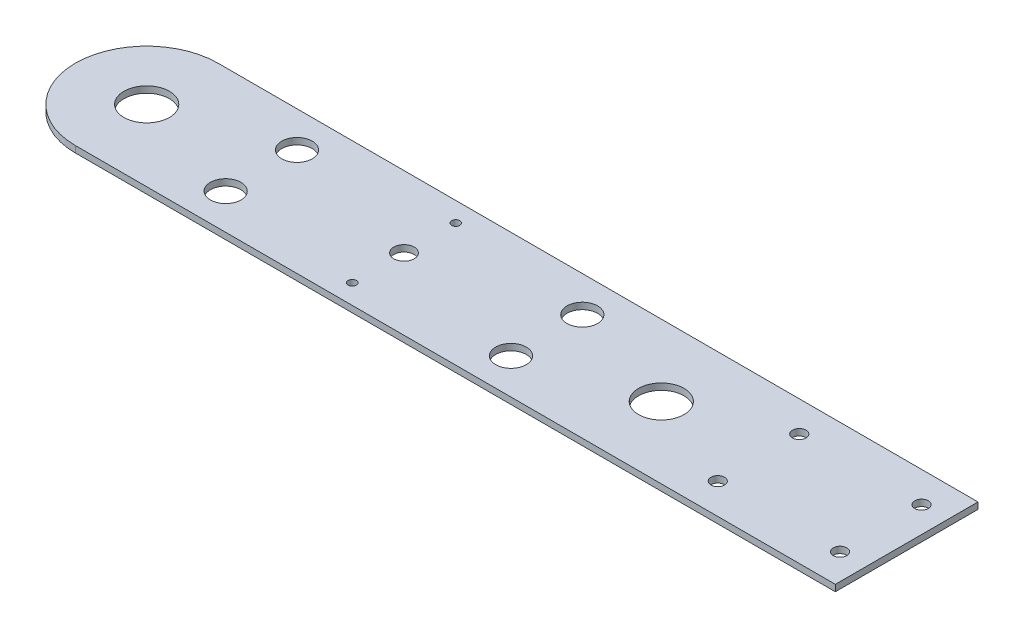
ISO-10303-21;
HEADER;
FILE_DESCRIPTION(('STEP AP214'),'2;1');
FILE_NAME('part.step','',(''),(''),'','','');
FILE_SCHEMA(('AUTOMOTIVE_DESIGN { 1 0 10303 214 1 1 1 1 }'));
ENDSEC;
DATA;
#1=APPLICATION_CONTEXT('core data for automotive mechanical design processes');
#2=APPLICATION_PROTOCOL_DEFINITION('international standard','automotive_design',2000,#1);
#3=PRODUCT_CONTEXT('',#1,'mechanical');
#4=PRODUCT('Part','Part','',(#3));
#5=PRODUCT_RELATED_PRODUCT_CATEGORY('part','',(#4));
#6=PRODUCT_DEFINITION_FORMATION('','',#4);
#7=PRODUCT_DEFINITION_CONTEXT('part definition',#1,'design');
#8=PRODUCT_DEFINITION('design','',#6,#7);
#9=PRODUCT_DEFINITION_SHAPE('','',#8);
#10=(LENGTH_UNIT() NAMED_UNIT(*) SI_UNIT(.MILLI.,.METRE.));
#11=(NAMED_UNIT(*) PLANE_ANGLE_UNIT() SI_UNIT($,.RADIAN.));
#12=(NAMED_UNIT(*) SI_UNIT($,.STERADIAN.) SOLID_ANGLE_UNIT());
#13=UNCERTAINTY_MEASURE_WITH_UNIT(LENGTH_MEASURE(1.E-05),#10,'distance_accuracy_value','');
#14=(GEOMETRIC_REPRESENTATION_CONTEXT(3) GLOBAL_UNCERTAINTY_ASSIGNED_CONTEXT((#13)) GLOBAL_UNIT_ASSIGNED_CONTEXT((#10,
#11,#12)) REPRESENTATION_CONTEXT('',''));
#15=CARTESIAN_POINT('',(0.,0.,0.));
#16=DIRECTION('',(0.,0.,1.));
#17=DIRECTION('',(1.,0.,0.));
#18=AXIS2_PLACEMENT_3D('',#15,#16,#17);
#19=CARTESIAN_POINT('',(-1.02661504070082E-12,3.175,-34.9999999999929));
#20=DIRECTION('',(0.,0.,-1.));
#21=DIRECTION('',(-1.,0.,0.));
#22=AXIS2_PLACEMENT_3D('',#19,#20,#21);
#23=PLANE('',#22);
#24=DIRECTION('',(1.,0.,0.));
#25=VECTOR('',#24,1.);
#26=CARTESIAN_POINT('',(-1.02661504070082E-12,0.,-34.9999999999929));
#27=LINE('',#26,#25);
#28=CARTESIAN_POINT('',(-126.258214395413,0.,-35.0000000000012));
#29=VERTEX_POINT('',#28);
#30=CARTESIAN_POINT('',(246.658214395413,0.,-35.0000000000001));
#31=VERTEX_POINT('',#30);
#32=EDGE_CURVE('E144',#29,#31,#27,.T.);
#33=ORIENTED_EDGE('',*,*,#32,.F.);
#34=DIRECTION('',(0.,-1.,0.));
#35=VECTOR('',#34,1.);
#36=CARTESIAN_POINT('',(-126.258214395413,3.175,-35.0000000000012));
#37=LINE('',#36,#35);
#38=CARTESIAN_POINT('',(-126.258214395413,3.175,-35.0000000000012));
#39=VERTEX_POINT('',#38);
#40=EDGE_CURVE('E11',#39,#29,#37,.T.);
#41=ORIENTED_EDGE('',*,*,#40,.F.);
#42=DIRECTION('',(1.,0.,0.));
#43=VECTOR('',#42,1.);
#44=CARTESIAN_POINT('',(-1.02661504070082E-12,3.175,-34.9999999999929));
#45=LINE('',#44,#43);
#46=CARTESIAN_POINT('',(246.658214395413,3.175,-35.0000000000001));
#47=VERTEX_POINT('',#46);
#48=EDGE_CURVE('E93',#39,#47,#45,.T.);
#49=ORIENTED_EDGE('',*,*,#48,.T.);
#50=DIRECTION('',(0.,-1.,0.));
#51=VECTOR('',#50,1.);
#52=CARTESIAN_POINT('',(246.658214395413,3.175,-35.0000000000001));
#53=LINE('',#52,#51);
#54=EDGE_CURVE('E74',#47,#31,#53,.T.);
#55=ORIENTED_EDGE('',*,*,#54,.T.);
#56=EDGE_LOOP('',(#33,#41,#49,#55));
#57=FACE_BOUND('',#56,.T.);
#58=ADVANCED_FACE('F35',(#57),#23,.T.);
#59=CARTESIAN_POINT('',(-126.258214395413,3.175,-2.40182936781888E-12));
#60=DIRECTION('',(0.,-1.,0.));
#61=DIRECTION('',(0.,0.,-1.));
#62=AXIS2_PLACEMENT_3D('',#59,#60,#61);
#63=CYLINDRICAL_SURFACE('',#62,35.);
#64=CARTESIAN_POINT('',(-126.258214395413,0.,-2.40182936781888E-12));
#65=DIRECTION('',(0.,1.,0.));
#66=DIRECTION('',(0.,0.,1.));
#67=AXIS2_PLACEMENT_3D('',#64,#65,#66);
#68=CIRCLE('',#67,35.);
#69=CARTESIAN_POINT('',(-126.258214395413,0.,34.9999999999988));
#70=VERTEX_POINT('',#69);
#71=EDGE_CURVE('E98',#29,#70,#68,.T.);
#72=ORIENTED_EDGE('',*,*,#71,.T.);
#73=DIRECTION('',(0.,-1.,0.));
#74=VECTOR('',#73,1.);
#75=CARTESIAN_POINT('',(-126.258214395413,3.175,34.9999999999988));
#76=LINE('',#75,#74);
#77=CARTESIAN_POINT('',(-126.258214395413,3.175,34.9999999999988));
#78=VERTEX_POINT('',#77);
#79=EDGE_CURVE('E44',#78,#70,#76,.T.);
#80=ORIENTED_EDGE('',*,*,#79,.F.);
#81=CARTESIAN_POINT('',(-126.258214395413,3.175,-2.40182936781888E-12));
#82=DIRECTION('',(0.,1.,0.));
#83=DIRECTION('',(0.,0.,1.));
#84=AXIS2_PLACEMENT_3D('',#81,#82,#83);
#85=CIRCLE('',#84,35.);
#86=EDGE_CURVE('E89',#39,#78,#85,.T.);
#87=ORIENTED_EDGE('',*,*,#86,.F.);
#88=ORIENTED_EDGE('',*,*,#40,.T.);
#89=EDGE_LOOP('',(#72,#80,#87,#88));
#90=FACE_BOUND('',#89,.T.);
#91=ADVANCED_FACE('F96',(#90),#63,.T.);
#92=CARTESIAN_POINT('',(0.,3.175,35.));
#93=DIRECTION('',(0.,0.,-1.));
#94=DIRECTION('',(-1.,0.,0.));
#95=AXIS2_PLACEMENT_3D('',#92,#93,#94);
#96=PLANE('',#95);
#97=DIRECTION('',(1.,0.,0.));
#98=VECTOR('',#97,1.);
#99=CARTESIAN_POINT('',(0.,0.,35.));
#100=LINE('',#99,#98);
#101=CARTESIAN_POINT('',(246.658214395413,0.,34.9999999999999));
#102=VERTEX_POINT('',#101);
#103=EDGE_CURVE('E141',#70,#102,#100,.T.);
#104=ORIENTED_EDGE('',*,*,#103,.T.);
#105=DIRECTION('',(0.,-1.,0.));
#106=VECTOR('',#105,1.);
#107=CARTESIAN_POINT('',(246.658214395413,3.175,34.9999999999999));
#108=LINE('',#107,#106);
#109=CARTESIAN_POINT('',(246.658214395413,3.175,34.9999999999999));
#110=VERTEX_POINT('',#109);
#111=EDGE_CURVE('E88',#110,#102,#108,.T.);
#112=ORIENTED_EDGE('',*,*,#111,.F.);
#113=DIRECTION('',(1.,0.,0.));
#114=VECTOR('',#113,1.);
#115=CARTESIAN_POINT('',(0.,3.175,35.));
#116=LINE('',#115,#114);
#117=EDGE_CURVE('E82',#78,#110,#116,.T.);
#118=ORIENTED_EDGE('',*,*,#117,.F.);
#119=ORIENTED_EDGE('',*,*,#79,.T.);
#120=EDGE_LOOP('',(#104,#112,#118,#119));
#121=FACE_BOUND('',#120,.T.);
#122=ADVANCED_FACE('F85',(#121),#96,.F.);
#123=CARTESIAN_POINT('',(-70.,3.175,17.5));
#124=DIRECTION('',(0.,-1.,0.));
#125=DIRECTION('',(0.,0.,-1.));
#126=AXIS2_PLACEMENT_3D('',#123,#124,#125);
#127=CYLINDRICAL_SURFACE('',#126,7.50000000000001);
#128=CARTESIAN_POINT('',(-70.,3.175,17.5));
#129=DIRECTION('',(0.,1.,0.));
#130=DIRECTION('',(0.,0.,1.));
#131=AXIS2_PLACEMENT_3D('',#128,#129,#130);
#132=CIRCLE('',#131,7.50000000000001);
#133=CARTESIAN_POINT('',(-70.,3.175,25.));
#134=VERTEX_POINT('',#133);
#135=EDGE_CURVE('E151',#134,#134,#132,.T.);
#136=ORIENTED_EDGE('',*,*,#135,.T.);
#137=EDGE_LOOP('',(#136));
#138=FACE_BOUND('',#137,.T.);
#139=CARTESIAN_POINT('',(-70.,0.,17.5));
#140=DIRECTION('',(0.,1.,0.));
#141=DIRECTION('',(0.,0.,1.));
#142=AXIS2_PLACEMENT_3D('',#139,#140,#141);
#143=CIRCLE('',#142,7.50000000000001);
#144=CARTESIAN_POINT('',(-70.,0.,25.));
#145=VERTEX_POINT('',#144);
#146=EDGE_CURVE('E107',#145,#145,#143,.T.);
#147=ORIENTED_EDGE('',*,*,#146,.F.);
#148=EDGE_LOOP('',(#147));
#149=FACE_BOUND('',#148,.T.);
#150=ADVANCED_FACE('F211',(#138,#149),#127,.F.);
#151=CARTESIAN_POINT('',(-70.,3.175,-17.5));
#152=DIRECTION('',(0.,-1.,0.));
#153=DIRECTION('',(0.,0.,-1.));
#154=AXIS2_PLACEMENT_3D('',#151,#152,#153);
#155=CYLINDRICAL_SURFACE('',#154,7.50000000000001);
#156=CARTESIAN_POINT('',(-70.,3.175,-17.5));
#157=DIRECTION('',(0.,1.,0.));
#158=DIRECTION('',(0.,0.,1.));
#159=AXIS2_PLACEMENT_3D('',#156,#157,#158);
#160=CIRCLE('',#159,7.50000000000001);
#161=CARTESIAN_POINT('',(-70.,3.175,-9.99999999999999));
#162=VERTEX_POINT('',#161);
#163=EDGE_CURVE('E154',#162,#162,#160,.T.);
#164=ORIENTED_EDGE('',*,*,#163,.T.);
#165=EDGE_LOOP('',(#164));
#166=FACE_BOUND('',#165,.T.);
#167=CARTESIAN_POINT('',(-70.,0.,-17.5));
#168=DIRECTION('',(0.,1.,0.));
#169=DIRECTION('',(0.,0.,1.));
#170=AXIS2_PLACEMENT_3D('',#167,#168,#169);
#171=CIRCLE('',#170,7.50000000000001);
#172=CARTESIAN_POINT('',(-70.,0.,-9.99999999999999));
#173=VERTEX_POINT('',#172);
#174=EDGE_CURVE('E110',#173,#173,#171,.T.);
#175=ORIENTED_EDGE('',*,*,#174,.F.);
#176=EDGE_LOOP('',(#175));
#177=FACE_BOUND('',#176,.T.);
#178=ADVANCED_FACE('F251',(#166,#177),#155,.F.);
#179=CARTESIAN_POINT('',(70.,3.175,-17.5));
#180=DIRECTION('',(0.,-1.,0.));
#181=DIRECTION('',(0.,0.,-1.));
#182=AXIS2_PLACEMENT_3D('',#179,#180,#181);
#183=CYLINDRICAL_SURFACE('',#182,7.50000000000001);
#184=CARTESIAN_POINT('',(70.,3.175,-17.5));
#185=DIRECTION('',(0.,1.,0.));
#186=DIRECTION('',(0.,0.,1.));
#187=AXIS2_PLACEMENT_3D('',#184,#185,#186);
#188=CIRCLE('',#187,7.50000000000001);
#189=CARTESIAN_POINT('',(70.,3.175,-10.));
#190=VERTEX_POINT('',#189);
#191=EDGE_CURVE('E157',#190,#190,#188,.T.);
#192=ORIENTED_EDGE('',*,*,#191,.T.);
#193=EDGE_LOOP('',(#192));
#194=FACE_BOUND('',#193,.T.);
#195=CARTESIAN_POINT('',(70.,0.,-17.5));
#196=DIRECTION('',(0.,1.,0.));
#197=DIRECTION('',(0.,0.,1.));
#198=AXIS2_PLACEMENT_3D('',#195,#196,#197);
#199=CIRCLE('',#198,7.50000000000001);
#200=CARTESIAN_POINT('',(70.,0.,-10.));
#201=VERTEX_POINT('',#200);
#202=EDGE_CURVE('E113',#201,#201,#199,.T.);
#203=ORIENTED_EDGE('',*,*,#202,.F.);
#204=EDGE_LOOP('',(#203));
#205=FACE_BOUND('',#204,.T.);
#206=ADVANCED_FACE('F247',(#194,#205),#183,.F.);
#207=CARTESIAN_POINT('',(70.,3.175,17.5));
#208=DIRECTION('',(0.,-1.,0.));
#209=DIRECTION('',(0.,0.,-1.));
#210=AXIS2_PLACEMENT_3D('',#207,#208,#209);
#211=CYLINDRICAL_SURFACE('',#210,7.50000000000001);
#212=CARTESIAN_POINT('',(70.,3.175,17.5));
#213=DIRECTION('',(0.,1.,0.));
#214=DIRECTION('',(0.,0.,1.));
#215=AXIS2_PLACEMENT_3D('',#212,#213,#214);
#216=CIRCLE('',#215,7.50000000000001);
#217=CARTESIAN_POINT('',(70.,3.175,25.));
#218=VERTEX_POINT('',#217);
#219=EDGE_CURVE('E160',#218,#218,#216,.T.);
#220=ORIENTED_EDGE('',*,*,#219,.T.);
#221=EDGE_LOOP('',(#220));
#222=FACE_BOUND('',#221,.T.);
#223=CARTESIAN_POINT('',(70.,0.,17.5));
#224=DIRECTION('',(0.,1.,0.));
#225=DIRECTION('',(0.,0.,1.));
#226=AXIS2_PLACEMENT_3D('',#223,#224,#225);
#227=CIRCLE('',#226,7.50000000000001);
#228=CARTESIAN_POINT('',(70.,0.,25.));
#229=VERTEX_POINT('',#228);
#230=EDGE_CURVE('E116',#229,#229,#227,.T.);
#231=ORIENTED_EDGE('',*,*,#230,.F.);
#232=EDGE_LOOP('',(#231));
#233=FACE_BOUND('',#232,.T.);
#234=ADVANCED_FACE('F243',(#222,#233),#211,.F.);
#235=CARTESIAN_POINT('',(126.258214395413,3.175,-2.4482158832565E-12));
#236=DIRECTION('',(0.,-1.,0.));
#237=DIRECTION('',(0.,0.,-1.));
#238=AXIS2_PLACEMENT_3D('',#235,#236,#237);
#239=CYLINDRICAL_SURFACE('',#238,11.15);
#240=CARTESIAN_POINT('',(126.258214395413,3.175,-2.4482158832565E-12));
#241=DIRECTION('',(0.,1.,0.));
#242=DIRECTION('',(0.,0.,1.));
#243=AXIS2_PLACEMENT_3D('',#240,#241,#242);
#244=CIRCLE('',#243,11.15);
#245=CARTESIAN_POINT('',(126.258214395413,3.175,11.1499999999975));
#246=VERTEX_POINT('',#245);
#247=EDGE_CURVE('E163',#246,#246,#244,.T.);
#248=ORIENTED_EDGE('',*,*,#247,.T.);
#249=EDGE_LOOP('',(#248));
#250=FACE_BOUND('',#249,.T.);
#251=CARTESIAN_POINT('',(126.258214395413,0.,-2.4482158832565E-12));
#252=DIRECTION('',(0.,1.,0.));
#253=DIRECTION('',(0.,0.,1.));
#254=AXIS2_PLACEMENT_3D('',#251,#252,#253);
#255=CIRCLE('',#254,11.15);
#256=CARTESIAN_POINT('',(126.258214395413,0.,11.1499999999975));
#257=VERTEX_POINT('',#256);
#258=EDGE_CURVE('E119',#257,#257,#255,.T.);
#259=ORIENTED_EDGE('',*,*,#258,.F.);
#260=EDGE_LOOP('',(#259));
#261=FACE_BOUND('',#260,.T.);
#262=ADVANCED_FACE('F239',(#250,#261),#239,.F.);
#263=CARTESIAN_POINT('',(0.,3.175,25.3999999999999));
#264=DIRECTION('',(0.,-1.,0.));
#265=DIRECTION('',(0.,0.,-1.));
#266=AXIS2_PLACEMENT_3D('',#263,#264,#265);
#267=CYLINDRICAL_SURFACE('',#266,2.02);
#268=CARTESIAN_POINT('',(0.,3.175,25.3999999999999));
#269=DIRECTION('',(0.,1.,0.));
#270=DIRECTION('',(0.,0.,1.));
#271=AXIS2_PLACEMENT_3D('',#268,#269,#270);
#272=CIRCLE('',#271,2.02);
#273=CARTESIAN_POINT('',(0.,3.175,27.4199999999999));
#274=VERTEX_POINT('',#273);
#275=EDGE_CURVE('E166',#274,#274,#272,.T.);
#276=ORIENTED_EDGE('',*,*,#275,.T.);
#277=EDGE_LOOP('',(#276));
#278=FACE_BOUND('',#277,.T.);
#279=CARTESIAN_POINT('',(0.,0.,25.3999999999999));
#280=DIRECTION('',(0.,1.,0.));
#281=DIRECTION('',(0.,0.,1.));
#282=AXIS2_PLACEMENT_3D('',#279,#280,#281);
#283=CIRCLE('',#282,2.02);
#284=CARTESIAN_POINT('',(0.,0.,27.4199999999999));
#285=VERTEX_POINT('',#284);
#286=EDGE_CURVE('E122',#285,#285,#283,.T.);
#287=ORIENTED_EDGE('',*,*,#286,.F.);
#288=EDGE_LOOP('',(#287));
#289=FACE_BOUND('',#288,.T.);
#290=ADVANCED_FACE('F235',(#278,#289),#267,.F.);
#291=CARTESIAN_POINT('',(0.,3.175,-25.4000000000001));
#292=DIRECTION('',(0.,-1.,0.));
#293=DIRECTION('',(0.,0.,-1.));
#294=AXIS2_PLACEMENT_3D('',#291,#292,#293);
#295=CYLINDRICAL_SURFACE('',#294,2.02);
#296=CARTESIAN_POINT('',(0.,3.175,-25.4000000000001));
#297=DIRECTION('',(0.,1.,0.));
#298=DIRECTION('',(0.,0.,1.));
#299=AXIS2_PLACEMENT_3D('',#296,#297,#298);
#300=CIRCLE('',#299,2.02);
#301=CARTESIAN_POINT('',(0.,3.175,-23.3800000000001));
#302=VERTEX_POINT('',#301);
#303=EDGE_CURVE('E169',#302,#302,#300,.T.);
#304=ORIENTED_EDGE('',*,*,#303,.T.);
#305=EDGE_LOOP('',(#304));
#306=FACE_BOUND('',#305,.T.);
#307=CARTESIAN_POINT('',(0.,0.,-25.4000000000001));
#308=DIRECTION('',(0.,1.,0.));
#309=DIRECTION('',(0.,0.,1.));
#310=AXIS2_PLACEMENT_3D('',#307,#308,#309);
#311=CIRCLE('',#310,2.02);
#312=CARTESIAN_POINT('',(0.,0.,-23.3800000000001));
#313=VERTEX_POINT('',#312);
#314=EDGE_CURVE('E125',#313,#313,#311,.T.);
#315=ORIENTED_EDGE('',*,*,#314,.F.);
#316=EDGE_LOOP('',(#315));
#317=FACE_BOUND('',#316,.T.);
#318=ADVANCED_FACE('F231',(#306,#317),#295,.F.);
#319=CARTESIAN_POINT('',(233.958214395413,3.175,19.9999999999999));
#320=DIRECTION('',(0.,-1.,0.));
#321=DIRECTION('',(0.,0.,-1.));
#322=AXIS2_PLACEMENT_3D('',#319,#320,#321);
#323=CYLINDRICAL_SURFACE('',#322,3.32499999999999);
#324=CARTESIAN_POINT('',(233.958214395413,3.175,19.9999999999999));
#325=DIRECTION('',(0.,1.,0.));
#326=DIRECTION('',(0.,0.,1.));
#327=AXIS2_PLACEMENT_3D('',#324,#325,#326);
#328=CIRCLE('',#327,3.32499999999999);
#329=CARTESIAN_POINT('',(233.958214395413,3.175,23.3249999999999));
#330=VERTEX_POINT('',#329);
#331=EDGE_CURVE('E172',#330,#330,#328,.T.);
#332=ORIENTED_EDGE('',*,*,#331,.T.);
#333=EDGE_LOOP('',(#332));
#334=FACE_BOUND('',#333,.T.);
#335=CARTESIAN_POINT('',(233.958214395413,0.,19.9999999999999));
#336=DIRECTION('',(0.,1.,0.));
#337=DIRECTION('',(0.,0.,1.));
#338=AXIS2_PLACEMENT_3D('',#335,#336,#337);
#339=CIRCLE('',#338,3.32499999999999);
#340=CARTESIAN_POINT('',(233.958214395413,0.,23.3249999999999));
#341=VERTEX_POINT('',#340);
#342=EDGE_CURVE('E128',#341,#341,#339,.T.);
#343=ORIENTED_EDGE('',*,*,#342,.F.);
#344=EDGE_LOOP('',(#343));
#345=FACE_BOUND('',#344,.T.);
#346=ADVANCED_FACE('F227',(#334,#345),#323,.F.);
#347=CARTESIAN_POINT('',(173.958214395413,3.175,19.9999999999999));
#348=DIRECTION('',(0.,-1.,0.));
#349=DIRECTION('',(0.,0.,-1.));
#350=AXIS2_PLACEMENT_3D('',#347,#348,#349);
#351=CYLINDRICAL_SURFACE('',#350,3.32499999999999);
#352=CARTESIAN_POINT('',(173.958214395413,3.175,19.9999999999999));
#353=DIRECTION('',(0.,1.,0.));
#354=DIRECTION('',(0.,0.,1.));
#355=AXIS2_PLACEMENT_3D('',#352,#353,#354);
#356=CIRCLE('',#355,3.32499999999999);
#357=CARTESIAN_POINT('',(173.958214395413,3.175,23.3249999999999));
#358=VERTEX_POINT('',#357);
#359=EDGE_CURVE('E175',#358,#358,#356,.T.);
#360=ORIENTED_EDGE('',*,*,#359,.T.);
#361=EDGE_LOOP('',(#360));
#362=FACE_BOUND('',#361,.T.);
#363=CARTESIAN_POINT('',(173.958214395413,0.,19.9999999999999));
#364=DIRECTION('',(0.,1.,0.));
#365=DIRECTION('',(0.,0.,1.));
#366=AXIS2_PLACEMENT_3D('',#363,#364,#365);
#367=CIRCLE('',#366,3.32499999999999);
#368=CARTESIAN_POINT('',(173.958214395413,0.,23.3249999999999));
#369=VERTEX_POINT('',#368);
#370=EDGE_CURVE('E131',#369,#369,#367,.T.);
#371=ORIENTED_EDGE('',*,*,#370,.F.);
#372=EDGE_LOOP('',(#371));
#373=FACE_BOUND('',#372,.T.);
#374=ADVANCED_FACE('F223',(#362,#373),#351,.F.);
#375=CARTESIAN_POINT('',(173.958214395413,3.175,-20.0000000000001));
#376=DIRECTION('',(0.,-1.,0.));
#377=DIRECTION('',(0.,0.,-1.));
#378=AXIS2_PLACEMENT_3D('',#375,#376,#377);
#379=CYLINDRICAL_SURFACE('',#378,3.32499999999999);
#380=CARTESIAN_POINT('',(173.958214395413,3.175,-20.0000000000001));
#381=DIRECTION('',(0.,1.,0.));
#382=DIRECTION('',(0.,0.,1.));
#383=AXIS2_PLACEMENT_3D('',#380,#381,#382);
#384=CIRCLE('',#383,3.32499999999999);
#385=CARTESIAN_POINT('',(173.958214395413,3.175,-16.6750000000001));
#386=VERTEX_POINT('',#385);
#387=EDGE_CURVE('E178',#386,#386,#384,.T.);
#388=ORIENTED_EDGE('',*,*,#387,.T.);
#389=EDGE_LOOP('',(#388));
#390=FACE_BOUND('',#389,.T.);
#391=CARTESIAN_POINT('',(173.958214395413,0.,-20.0000000000001));
#392=DIRECTION('',(0.,1.,0.));
#393=DIRECTION('',(0.,0.,1.));
#394=AXIS2_PLACEMENT_3D('',#391,#392,#393);
#395=CIRCLE('',#394,3.32499999999999);
#396=CARTESIAN_POINT('',(173.958214395413,0.,-16.6750000000001));
#397=VERTEX_POINT('',#396);
#398=EDGE_CURVE('E134',#397,#397,#395,.T.);
#399=ORIENTED_EDGE('',*,*,#398,.F.);
#400=EDGE_LOOP('',(#399));
#401=FACE_BOUND('',#400,.T.);
#402=ADVANCED_FACE('F219',(#390,#401),#379,.F.);
#403=CARTESIAN_POINT('',(233.958214395413,3.175,-20.0000000000001));
#404=DIRECTION('',(0.,-1.,0.));
#405=DIRECTION('',(0.,0.,-1.));
#406=AXIS2_PLACEMENT_3D('',#403,#404,#405);
#407=CYLINDRICAL_SURFACE('',#406,3.32499999999999);
#408=CARTESIAN_POINT('',(233.958214395413,3.175,-20.0000000000001));
#409=DIRECTION('',(0.,1.,0.));
#410=DIRECTION('',(0.,0.,1.));
#411=AXIS2_PLACEMENT_3D('',#408,#409,#410);
#412=CIRCLE('',#411,3.32499999999999);
#413=CARTESIAN_POINT('',(233.958214395413,3.175,-16.6750000000001));
#414=VERTEX_POINT('',#413);
#415=EDGE_CURVE('E181',#414,#414,#412,.T.);
#416=ORIENTED_EDGE('',*,*,#415,.T.);
#417=EDGE_LOOP('',(#416));
#418=FACE_BOUND('',#417,.T.);
#419=CARTESIAN_POINT('',(233.958214395413,0.,-20.0000000000001));
#420=DIRECTION('',(0.,1.,0.));
#421=DIRECTION('',(0.,0.,1.));
#422=AXIS2_PLACEMENT_3D('',#419,#420,#421);
#423=CIRCLE('',#422,3.32499999999999);
#424=CARTESIAN_POINT('',(233.958214395413,0.,-16.6750000000001));
#425=VERTEX_POINT('',#424);
#426=EDGE_CURVE('E137',#425,#425,#423,.T.);
#427=ORIENTED_EDGE('',*,*,#426,.F.);
#428=EDGE_LOOP('',(#427));
#429=FACE_BOUND('',#428,.T.);
#430=ADVANCED_FACE('F215',(#418,#429),#407,.F.);
#431=CARTESIAN_POINT('',(246.658214395413,3.175,0.));
#432=DIRECTION('',(-1.,0.,0.));
#433=DIRECTION('',(0.,0.,1.));
#434=AXIS2_PLACEMENT_3D('',#431,#432,#433);
#435=PLANE('',#434);
#436=DIRECTION('',(0.,0.,-1.));
#437=VECTOR('',#436,1.);
#438=CARTESIAN_POINT('',(246.658214395413,0.,0.));
#439=LINE('',#438,#437);
#440=EDGE_CURVE('E67',#102,#31,#439,.T.);
#441=ORIENTED_EDGE('',*,*,#440,.T.);
#442=ORIENTED_EDGE('',*,*,#54,.F.);
#443=DIRECTION('',(0.,0.,-1.));
#444=VECTOR('',#443,1.);
#445=CARTESIAN_POINT('',(246.658214395413,3.175,0.));
#446=LINE('',#445,#444);
#447=EDGE_CURVE('E52',#110,#47,#446,.T.);
#448=ORIENTED_EDGE('',*,*,#447,.F.);
#449=ORIENTED_EDGE('',*,*,#111,.T.);
#450=EDGE_LOOP('',(#441,#442,#448,#449));
#451=FACE_BOUND('',#450,.T.);
#452=ADVANCED_FACE('F212',(#451),#435,.F.);
#453=CARTESIAN_POINT('',(0.,3.175,0.));
#454=DIRECTION('',(0.,-1.,0.));
#455=DIRECTION('',(0.,0.,-1.));
#456=AXIS2_PLACEMENT_3D('',#453,#454,#455);
#457=CYLINDRICAL_SURFACE('',#456,4.99999999999795);
#458=CARTESIAN_POINT('',(0.,3.175,0.));
#459=DIRECTION('',(0.,1.,0.));
#460=DIRECTION('',(0.,0.,1.));
#461=AXIS2_PLACEMENT_3D('',#458,#459,#460);
#462=CIRCLE('',#461,4.99999999999795);
#463=CARTESIAN_POINT('',(0.,3.175,4.9999999999979));
#464=VERTEX_POINT('',#463);
#465=EDGE_CURVE('E106',#464,#464,#462,.T.);
#466=ORIENTED_EDGE('',*,*,#465,.T.);
#467=EDGE_LOOP('',(#466));
#468=FACE_BOUND('',#467,.T.);
#469=CARTESIAN_POINT('',(0.,0.,0.));
#470=DIRECTION('',(0.,1.,0.));
#471=DIRECTION('',(0.,0.,1.));
#472=AXIS2_PLACEMENT_3D('',#469,#470,#471);
#473=CIRCLE('',#472,4.99999999999795);
#474=CARTESIAN_POINT('',(0.,0.,4.9999999999979));
#475=VERTEX_POINT('',#474);
#476=EDGE_CURVE('E146',#475,#475,#473,.T.);
#477=ORIENTED_EDGE('',*,*,#476,.F.);
#478=EDGE_LOOP('',(#477));
#479=FACE_BOUND('',#478,.T.);
#480=ADVANCED_FACE('F37',(#468,#479),#457,.F.);
#481=CARTESIAN_POINT('',(-126.258214395413,3.175,-2.40182936781888E-12));
#482=DIRECTION('',(0.,-1.,0.));
#483=DIRECTION('',(0.,0.,-1.));
#484=AXIS2_PLACEMENT_3D('',#481,#482,#483);
#485=CYLINDRICAL_SURFACE('',#484,11.15);
#486=CARTESIAN_POINT('',(-126.258214395413,3.175,-2.40182936781888E-12));
#487=DIRECTION('',(0.,1.,0.));
#488=DIRECTION('',(0.,0.,1.));
#489=AXIS2_PLACEMENT_3D('',#486,#487,#488);
#490=CIRCLE('',#489,11.15);
#491=CARTESIAN_POINT('',(-126.258214395413,3.175,11.1499999999976));
#492=VERTEX_POINT('',#491);
#493=EDGE_CURVE('E102',#492,#492,#490,.T.);
#494=ORIENTED_EDGE('',*,*,#493,.T.);
#495=EDGE_LOOP('',(#494));
#496=FACE_BOUND('',#495,.T.);
#497=CARTESIAN_POINT('',(-126.258214395413,0.,-2.40182936781888E-12));
#498=DIRECTION('',(0.,1.,0.));
#499=DIRECTION('',(0.,0.,1.));
#500=AXIS2_PLACEMENT_3D('',#497,#498,#499);
#501=CIRCLE('',#500,11.15);
#502=CARTESIAN_POINT('',(-126.258214395413,0.,11.1499999999976));
#503=VERTEX_POINT('',#502);
#504=EDGE_CURVE('E103',#503,#503,#501,.T.);
#505=ORIENTED_EDGE('',*,*,#504,.F.);
#506=EDGE_LOOP('',(#505));
#507=FACE_BOUND('',#506,.T.);
#508=ADVANCED_FACE('F193',(#496,#507),#485,.F.);
#509=CARTESIAN_POINT('',(0.,3.175,0.));
#510=DIRECTION('',(0.,1.,0.));
#511=DIRECTION('',(0.,0.,1.));
#512=AXIS2_PLACEMENT_3D('',#509,#510,#511);
#513=PLANE('',#512);
#514=ORIENTED_EDGE('',*,*,#465,.F.);
#515=EDGE_LOOP('',(#514));
#516=FACE_BOUND('',#515,.T.);
#517=ORIENTED_EDGE('',*,*,#48,.F.);
#518=ORIENTED_EDGE('',*,*,#86,.T.);
#519=ORIENTED_EDGE('',*,*,#117,.T.);
#520=ORIENTED_EDGE('',*,*,#447,.T.);
#521=EDGE_LOOP('',(#517,#518,#519,#520));
#522=FACE_BOUND('',#521,.T.);
#523=ORIENTED_EDGE('',*,*,#415,.F.);
#524=EDGE_LOOP('',(#523));
#525=FACE_BOUND('',#524,.T.);
#526=ORIENTED_EDGE('',*,*,#387,.F.);
#527=EDGE_LOOP('',(#526));
#528=FACE_BOUND('',#527,.T.);
#529=ORIENTED_EDGE('',*,*,#359,.F.);
#530=EDGE_LOOP('',(#529));
#531=FACE_BOUND('',#530,.T.);
#532=ORIENTED_EDGE('',*,*,#331,.F.);
#533=EDGE_LOOP('',(#532));
#534=FACE_BOUND('',#533,.T.);
#535=ORIENTED_EDGE('',*,*,#303,.F.);
#536=EDGE_LOOP('',(#535));
#537=FACE_BOUND('',#536,.T.);
#538=ORIENTED_EDGE('',*,*,#275,.F.);
#539=EDGE_LOOP('',(#538));
#540=FACE_BOUND('',#539,.T.);
#541=ORIENTED_EDGE('',*,*,#247,.F.);
#542=EDGE_LOOP('',(#541));
#543=FACE_BOUND('',#542,.T.);
#544=ORIENTED_EDGE('',*,*,#219,.F.);
#545=EDGE_LOOP('',(#544));
#546=FACE_BOUND('',#545,.T.);
#547=ORIENTED_EDGE('',*,*,#191,.F.);
#548=EDGE_LOOP('',(#547));
#549=FACE_BOUND('',#548,.T.);
#550=ORIENTED_EDGE('',*,*,#163,.F.);
#551=EDGE_LOOP('',(#550));
#552=FACE_BOUND('',#551,.T.);
#553=ORIENTED_EDGE('',*,*,#135,.F.);
#554=EDGE_LOOP('',(#553));
#555=FACE_BOUND('',#554,.T.);
#556=ORIENTED_EDGE('',*,*,#493,.F.);
#557=EDGE_LOOP('',(#556));
#558=FACE_BOUND('',#557,.T.);
#559=ADVANCED_FACE('F91',(#516,#522,#525,#528,#531,#534,#537,#540,#543,#546,#549,#552,#555,
#558),#513,.T.);
#560=CARTESIAN_POINT('',(0.,0.,0.));
#561=DIRECTION('',(0.,1.,0.));
#562=DIRECTION('',(0.,0.,1.));
#563=AXIS2_PLACEMENT_3D('',#560,#561,#562);
#564=PLANE('',#563);
#565=ORIENTED_EDGE('',*,*,#476,.T.);
#566=EDGE_LOOP('',(#565));
#567=FACE_BOUND('',#566,.T.);
#568=ORIENTED_EDGE('',*,*,#32,.T.);
#569=ORIENTED_EDGE('',*,*,#440,.F.);
#570=ORIENTED_EDGE('',*,*,#103,.F.);
#571=ORIENTED_EDGE('',*,*,#71,.F.);
#572=EDGE_LOOP('',(#568,#569,#570,#571));
#573=FACE_BOUND('',#572,.T.);
#574=ORIENTED_EDGE('',*,*,#426,.T.);
#575=EDGE_LOOP('',(#574));
#576=FACE_BOUND('',#575,.T.);
#577=ORIENTED_EDGE('',*,*,#398,.T.);
#578=EDGE_LOOP('',(#577));
#579=FACE_BOUND('',#578,.T.);
#580=ORIENTED_EDGE('',*,*,#370,.T.);
#581=EDGE_LOOP('',(#580));
#582=FACE_BOUND('',#581,.T.);
#583=ORIENTED_EDGE('',*,*,#342,.T.);
#584=EDGE_LOOP('',(#583));
#585=FACE_BOUND('',#584,.T.);
#586=ORIENTED_EDGE('',*,*,#314,.T.);
#587=EDGE_LOOP('',(#586));
#588=FACE_BOUND('',#587,.T.);
#589=ORIENTED_EDGE('',*,*,#286,.T.);
#590=EDGE_LOOP('',(#589));
#591=FACE_BOUND('',#590,.T.);
#592=ORIENTED_EDGE('',*,*,#258,.T.);
#593=EDGE_LOOP('',(#592));
#594=FACE_BOUND('',#593,.T.);
#595=ORIENTED_EDGE('',*,*,#230,.T.);
#596=EDGE_LOOP('',(#595));
#597=FACE_BOUND('',#596,.T.);
#598=ORIENTED_EDGE('',*,*,#202,.T.);
#599=EDGE_LOOP('',(#598));
#600=FACE_BOUND('',#599,.T.);
#601=ORIENTED_EDGE('',*,*,#174,.T.);
#602=EDGE_LOOP('',(#601));
#603=FACE_BOUND('',#602,.T.);
#604=ORIENTED_EDGE('',*,*,#146,.T.);
#605=EDGE_LOOP('',(#604));
#606=FACE_BOUND('',#605,.T.);
#607=ORIENTED_EDGE('',*,*,#504,.T.);
#608=EDGE_LOOP('',(#607));
#609=FACE_BOUND('',#608,.T.);
#610=ADVANCED_FACE('F192',(#567,#573,#576,#579,#582,#585,#588,#591,#594,#597,#600,#603,#606,
#609),#564,.F.);
#611=CLOSED_SHELL('',(#58,#91,#122,#150,#178,#206,#234,#262,#290,#318,#346,#374,#402,#430,#452,
#480,#508,#559,#610));
#612=MANIFOLD_SOLID_BREP('B2',#611);
#613=ADVANCED_BREP_SHAPE_REPRESENTATION('',(#18,#612),#14);
#614=SHAPE_DEFINITION_REPRESENTATION(#9,#613);
ENDSEC;
END-ISO-10303-21;
